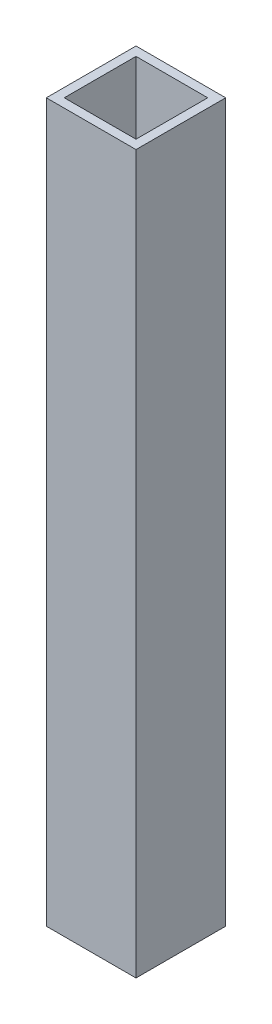
ISO-10303-21;
HEADER;
FILE_DESCRIPTION(('STEP AP214'),'2;1');
FILE_NAME('part.step','',(''),(''),'','','');
FILE_SCHEMA(('AUTOMOTIVE_DESIGN { 1 0 10303 214 1 1 1 1 }'));
ENDSEC;
DATA;
#1=APPLICATION_CONTEXT('core data for automotive mechanical design processes');
#2=APPLICATION_PROTOCOL_DEFINITION('international standard','automotive_design',2000,#1);
#3=PRODUCT_CONTEXT('',#1,'mechanical');
#4=PRODUCT('Part','Part','',(#3));
#5=PRODUCT_RELATED_PRODUCT_CATEGORY('part','',(#4));
#6=PRODUCT_DEFINITION_FORMATION('','',#4);
#7=PRODUCT_DEFINITION_CONTEXT('part definition',#1,'design');
#8=PRODUCT_DEFINITION('design','',#6,#7);
#9=PRODUCT_DEFINITION_SHAPE('','',#8);
#10=(LENGTH_UNIT() NAMED_UNIT(*) SI_UNIT(.MILLI.,.METRE.));
#11=(NAMED_UNIT(*) PLANE_ANGLE_UNIT() SI_UNIT($,.RADIAN.));
#12=(NAMED_UNIT(*) SI_UNIT($,.STERADIAN.) SOLID_ANGLE_UNIT());
#13=UNCERTAINTY_MEASURE_WITH_UNIT(LENGTH_MEASURE(1.E-05),#10,'distance_accuracy_value','');
#14=(GEOMETRIC_REPRESENTATION_CONTEXT(3) GLOBAL_UNCERTAINTY_ASSIGNED_CONTEXT((#13)) GLOBAL_UNIT_ASSIGNED_CONTEXT((#10,
#11,#12)) REPRESENTATION_CONTEXT('',''));
#15=CARTESIAN_POINT('',(0.,0.,0.));
#16=DIRECTION('',(0.,0.,1.));
#17=DIRECTION('',(1.,0.,0.));
#18=AXIS2_PLACEMENT_3D('',#15,#16,#17);
#19=CARTESIAN_POINT('',(15.,0.,-5.));
#20=DIRECTION('',(0.,0.,-1.));
#21=DIRECTION('',(-1.,0.,0.));
#22=AXIS2_PLACEMENT_3D('',#19,#20,#21);
#23=PLANE('',#22);
#24=DIRECTION('',(1.,0.,0.));
#25=VECTOR('',#24,1.);
#26=CARTESIAN_POINT('',(15.,-80.,-5.));
#27=LINE('',#26,#25);
#28=CARTESIAN_POINT('',(15.,-80.,-5.));
#29=VERTEX_POINT('',#28);
#30=CARTESIAN_POINT('',(25.,-80.,-5.));
#31=VERTEX_POINT('',#30);
#32=EDGE_CURVE('E131',#29,#31,#27,.T.);
#33=ORIENTED_EDGE('',*,*,#32,.F.);
#34=DIRECTION('',(0.,-1.,0.));
#35=VECTOR('',#34,1.);
#36=CARTESIAN_POINT('',(15.,0.,-5.));
#37=LINE('',#36,#35);
#38=CARTESIAN_POINT('',(15.,0.,-5.));
#39=VERTEX_POINT('',#38);
#40=EDGE_CURVE('E11',#39,#29,#37,.T.);
#41=ORIENTED_EDGE('',*,*,#40,.F.);
#42=DIRECTION('',(1.,0.,0.));
#43=VECTOR('',#42,1.);
#44=CARTESIAN_POINT('',(15.,0.,-5.));
#45=LINE('',#44,#43);
#46=CARTESIAN_POINT('',(25.,0.,-5.));
#47=VERTEX_POINT('',#46);
#48=EDGE_CURVE('E135',#39,#47,#45,.T.);
#49=ORIENTED_EDGE('',*,*,#48,.T.);
#50=DIRECTION('',(0.,-1.,0.));
#51=VECTOR('',#50,1.);
#52=CARTESIAN_POINT('',(25.,0.,-5.));
#53=LINE('',#52,#51);
#54=EDGE_CURVE('E36',#47,#31,#53,.T.);
#55=ORIENTED_EDGE('',*,*,#54,.T.);
#56=EDGE_LOOP('',(#33,#41,#49,#55));
#57=FACE_BOUND('',#56,.T.);
#58=ADVANCED_FACE('F33',(#57),#23,.T.);
#59=CARTESIAN_POINT('',(15.,0.,5.));
#60=DIRECTION('',(-1.,0.,0.));
#61=DIRECTION('',(0.,0.,1.));
#62=AXIS2_PLACEMENT_3D('',#59,#60,#61);
#63=PLANE('',#62);
#64=DIRECTION('',(0.,0.,-1.));
#65=VECTOR('',#64,1.);
#66=CARTESIAN_POINT('',(15.,-80.,5.));
#67=LINE('',#66,#65);
#68=CARTESIAN_POINT('',(15.,-80.,5.));
#69=VERTEX_POINT('',#68);
#70=EDGE_CURVE('E139',#69,#29,#67,.T.);
#71=ORIENTED_EDGE('',*,*,#70,.F.);
#72=DIRECTION('',(0.,-1.,0.));
#73=VECTOR('',#72,1.);
#74=CARTESIAN_POINT('',(15.,0.,5.));
#75=LINE('',#74,#73);
#76=CARTESIAN_POINT('',(15.,0.,5.));
#77=VERTEX_POINT('',#76);
#78=EDGE_CURVE('E41',#77,#69,#75,.T.);
#79=ORIENTED_EDGE('',*,*,#78,.F.);
#80=DIRECTION('',(0.,0.,-1.));
#81=VECTOR('',#80,1.);
#82=CARTESIAN_POINT('',(15.,0.,5.));
#83=LINE('',#82,#81);
#84=EDGE_CURVE('E145',#77,#39,#83,.T.);
#85=ORIENTED_EDGE('',*,*,#84,.T.);
#86=ORIENTED_EDGE('',*,*,#40,.T.);
#87=EDGE_LOOP('',(#71,#79,#85,#86));
#88=FACE_BOUND('',#87,.T.);
#89=ADVANCED_FACE('F171',(#88),#63,.T.);
#90=CARTESIAN_POINT('',(25.,0.,5.));
#91=DIRECTION('',(0.,0.,1.));
#92=DIRECTION('',(1.,0.,0.));
#93=AXIS2_PLACEMENT_3D('',#90,#91,#92);
#94=PLANE('',#93);
#95=DIRECTION('',(-1.,0.,0.));
#96=VECTOR('',#95,1.);
#97=CARTESIAN_POINT('',(25.,-80.,5.));
#98=LINE('',#97,#96);
#99=CARTESIAN_POINT('',(25.,-80.,5.));
#100=VERTEX_POINT('',#99);
#101=EDGE_CURVE('E153',#100,#69,#98,.T.);
#102=ORIENTED_EDGE('',*,*,#101,.F.);
#103=DIRECTION('',(0.,-1.,0.));
#104=VECTOR('',#103,1.);
#105=CARTESIAN_POINT('',(25.,0.,5.));
#106=LINE('',#105,#104);
#107=CARTESIAN_POINT('',(25.,0.,5.));
#108=VERTEX_POINT('',#107);
#109=EDGE_CURVE('E158',#108,#100,#106,.T.);
#110=ORIENTED_EDGE('',*,*,#109,.F.);
#111=DIRECTION('',(-1.,0.,0.));
#112=VECTOR('',#111,1.);
#113=CARTESIAN_POINT('',(25.,0.,5.));
#114=LINE('',#113,#112);
#115=EDGE_CURVE('E142',#108,#77,#114,.T.);
#116=ORIENTED_EDGE('',*,*,#115,.T.);
#117=ORIENTED_EDGE('',*,*,#78,.T.);
#118=EDGE_LOOP('',(#102,#110,#116,#117));
#119=FACE_BOUND('',#118,.T.);
#120=ADVANCED_FACE('F175',(#119),#94,.T.);
#121=CARTESIAN_POINT('',(25.,0.,-5.));
#122=DIRECTION('',(1.,0.,0.));
#123=DIRECTION('',(0.,0.,-1.));
#124=AXIS2_PLACEMENT_3D('',#121,#122,#123);
#125=PLANE('',#124);
#126=DIRECTION('',(0.,0.,1.));
#127=VECTOR('',#126,1.);
#128=CARTESIAN_POINT('',(25.,-80.,-5.));
#129=LINE('',#128,#127);
#130=EDGE_CURVE('E150',#31,#100,#129,.T.);
#131=ORIENTED_EDGE('',*,*,#130,.F.);
#132=ORIENTED_EDGE('',*,*,#54,.F.);
#133=DIRECTION('',(0.,0.,1.));
#134=VECTOR('',#133,1.);
#135=CARTESIAN_POINT('',(25.,0.,-5.));
#136=LINE('',#135,#134);
#137=EDGE_CURVE('E138',#47,#108,#136,.T.);
#138=ORIENTED_EDGE('',*,*,#137,.T.);
#139=ORIENTED_EDGE('',*,*,#109,.T.);
#140=EDGE_LOOP('',(#131,#132,#138,#139));
#141=FACE_BOUND('',#140,.T.);
#142=ADVANCED_FACE('F166',(#141),#125,.T.);
#143=CARTESIAN_POINT('',(0.,0.,0.));
#144=DIRECTION('',(0.,-1.,0.));
#145=DIRECTION('',(0.,0.,-1.));
#146=AXIS2_PLACEMENT_3D('',#143,#144,#145);
#147=PLANE('',#146);
#148=DIRECTION('',(0.,0.,1.));
#149=VECTOR('',#148,1.);
#150=CARTESIAN_POINT('',(24.,0.,4.));
#151=LINE('',#150,#149);
#152=CARTESIAN_POINT('',(24.,0.,-4.));
#153=VERTEX_POINT('',#152);
#154=CARTESIAN_POINT('',(24.,0.,4.));
#155=VERTEX_POINT('',#154);
#156=EDGE_CURVE('E106',#153,#155,#151,.T.);
#157=ORIENTED_EDGE('',*,*,#156,.T.);
#158=DIRECTION('',(-1.,0.,0.));
#159=VECTOR('',#158,1.);
#160=CARTESIAN_POINT('',(16.,0.,4.));
#161=LINE('',#160,#159);
#162=CARTESIAN_POINT('',(16.,0.,4.));
#163=VERTEX_POINT('',#162);
#164=EDGE_CURVE('E100',#155,#163,#161,.T.);
#165=ORIENTED_EDGE('',*,*,#164,.T.);
#166=DIRECTION('',(0.,0.,-1.));
#167=VECTOR('',#166,1.);
#168=CARTESIAN_POINT('',(16.,0.,-4.));
#169=LINE('',#168,#167);
#170=CARTESIAN_POINT('',(16.,0.,-4.));
#171=VERTEX_POINT('',#170);
#172=EDGE_CURVE('E109',#163,#171,#169,.T.);
#173=ORIENTED_EDGE('',*,*,#172,.T.);
#174=DIRECTION('',(1.,0.,0.));
#175=VECTOR('',#174,1.);
#176=CARTESIAN_POINT('',(24.,0.,-4.));
#177=LINE('',#176,#175);
#178=EDGE_CURVE('E49',#171,#153,#177,.T.);
#179=ORIENTED_EDGE('',*,*,#178,.T.);
#180=EDGE_LOOP('',(#157,#165,#173,#179));
#181=FACE_BOUND('',#180,.T.);
#182=ORIENTED_EDGE('',*,*,#48,.F.);
#183=ORIENTED_EDGE('',*,*,#84,.F.);
#184=ORIENTED_EDGE('',*,*,#115,.F.);
#185=ORIENTED_EDGE('',*,*,#137,.F.);
#186=EDGE_LOOP('',(#182,#183,#184,#185));
#187=FACE_BOUND('',#186,.T.);
#188=ADVANCED_FACE('F113',(#181,#187),#147,.F.);
#189=CARTESIAN_POINT('',(0.,-80.,0.));
#190=DIRECTION('',(0.,-1.,0.));
#191=DIRECTION('',(0.,0.,-1.));
#192=AXIS2_PLACEMENT_3D('',#189,#190,#191);
#193=PLANE('',#192);
#194=DIRECTION('',(-1.,0.,0.));
#195=VECTOR('',#194,1.);
#196=CARTESIAN_POINT('',(16.,-80.,4.));
#197=LINE('',#196,#195);
#198=CARTESIAN_POINT('',(24.,-80.,4.));
#199=VERTEX_POINT('',#198);
#200=CARTESIAN_POINT('',(16.,-80.,4.));
#201=VERTEX_POINT('',#200);
#202=EDGE_CURVE('E57',#199,#201,#197,.T.);
#203=ORIENTED_EDGE('',*,*,#202,.F.);
#204=DIRECTION('',(0.,0.,1.));
#205=VECTOR('',#204,1.);
#206=CARTESIAN_POINT('',(24.,-80.,4.));
#207=LINE('',#206,#205);
#208=CARTESIAN_POINT('',(24.,-80.,-4.));
#209=VERTEX_POINT('',#208);
#210=EDGE_CURVE('E116',#209,#199,#207,.T.);
#211=ORIENTED_EDGE('',*,*,#210,.F.);
#212=DIRECTION('',(1.,0.,0.));
#213=VECTOR('',#212,1.);
#214=CARTESIAN_POINT('',(24.,-80.,-4.));
#215=LINE('',#214,#213);
#216=CARTESIAN_POINT('',(16.,-80.,-4.));
#217=VERTEX_POINT('',#216);
#218=EDGE_CURVE('E119',#217,#209,#215,.T.);
#219=ORIENTED_EDGE('',*,*,#218,.F.);
#220=DIRECTION('',(0.,0.,-1.));
#221=VECTOR('',#220,1.);
#222=CARTESIAN_POINT('',(16.,-80.,-4.));
#223=LINE('',#222,#221);
#224=EDGE_CURVE('E125',#201,#217,#223,.T.);
#225=ORIENTED_EDGE('',*,*,#224,.F.);
#226=EDGE_LOOP('',(#203,#211,#219,#225));
#227=FACE_BOUND('',#226,.T.);
#228=ORIENTED_EDGE('',*,*,#32,.T.);
#229=ORIENTED_EDGE('',*,*,#130,.T.);
#230=ORIENTED_EDGE('',*,*,#101,.T.);
#231=ORIENTED_EDGE('',*,*,#70,.T.);
#232=EDGE_LOOP('',(#228,#229,#230,#231));
#233=FACE_BOUND('',#232,.T.);
#234=ADVANCED_FACE('F168',(#227,#233),#193,.T.);
#235=CARTESIAN_POINT('',(16.,0.,4.));
#236=DIRECTION('',(0.,0.,1.));
#237=DIRECTION('',(1.,0.,0.));
#238=AXIS2_PLACEMENT_3D('',#235,#236,#237);
#239=PLANE('',#238);
#240=ORIENTED_EDGE('',*,*,#202,.T.);
#241=DIRECTION('',(0.,-1.,0.));
#242=VECTOR('',#241,1.);
#243=CARTESIAN_POINT('',(16.,0.,4.));
#244=LINE('',#243,#242);
#245=EDGE_CURVE('E96',#163,#201,#244,.T.);
#246=ORIENTED_EDGE('',*,*,#245,.F.);
#247=ORIENTED_EDGE('',*,*,#164,.F.);
#248=DIRECTION('',(0.,-1.,0.));
#249=VECTOR('',#248,1.);
#250=CARTESIAN_POINT('',(24.,0.,4.));
#251=LINE('',#250,#249);
#252=EDGE_CURVE('E129',#155,#199,#251,.T.);
#253=ORIENTED_EDGE('',*,*,#252,.T.);
#254=EDGE_LOOP('',(#240,#246,#247,#253));
#255=FACE_BOUND('',#254,.T.);
#256=ADVANCED_FACE('F98',(#255),#239,.F.);
#257=CARTESIAN_POINT('',(24.,0.,4.));
#258=DIRECTION('',(1.,0.,0.));
#259=DIRECTION('',(0.,0.,-1.));
#260=AXIS2_PLACEMENT_3D('',#257,#258,#259);
#261=PLANE('',#260);
#262=ORIENTED_EDGE('',*,*,#210,.T.);
#263=ORIENTED_EDGE('',*,*,#252,.F.);
#264=ORIENTED_EDGE('',*,*,#156,.F.);
#265=DIRECTION('',(0.,-1.,0.));
#266=VECTOR('',#265,1.);
#267=CARTESIAN_POINT('',(24.,0.,-4.));
#268=LINE('',#267,#266);
#269=EDGE_CURVE('E132',#153,#209,#268,.T.);
#270=ORIENTED_EDGE('',*,*,#269,.T.);
#271=EDGE_LOOP('',(#262,#263,#264,#270));
#272=FACE_BOUND('',#271,.T.);
#273=ADVANCED_FACE('F226',(#272),#261,.F.);
#274=CARTESIAN_POINT('',(24.,0.,-4.));
#275=DIRECTION('',(0.,0.,-1.));
#276=DIRECTION('',(-1.,0.,0.));
#277=AXIS2_PLACEMENT_3D('',#274,#275,#276);
#278=PLANE('',#277);
#279=ORIENTED_EDGE('',*,*,#218,.T.);
#280=ORIENTED_EDGE('',*,*,#269,.F.);
#281=ORIENTED_EDGE('',*,*,#178,.F.);
#282=DIRECTION('',(0.,-1.,0.));
#283=VECTOR('',#282,1.);
#284=CARTESIAN_POINT('',(16.,0.,-4.));
#285=LINE('',#284,#283);
#286=EDGE_CURVE('E105',#171,#217,#285,.T.);
#287=ORIENTED_EDGE('',*,*,#286,.T.);
#288=EDGE_LOOP('',(#279,#280,#281,#287));
#289=FACE_BOUND('',#288,.T.);
#290=ADVANCED_FACE('F235',(#289),#278,.F.);
#291=CARTESIAN_POINT('',(16.,0.,-4.));
#292=DIRECTION('',(-1.,0.,0.));
#293=DIRECTION('',(0.,0.,1.));
#294=AXIS2_PLACEMENT_3D('',#291,#292,#293);
#295=PLANE('',#294);
#296=ORIENTED_EDGE('',*,*,#224,.T.);
#297=ORIENTED_EDGE('',*,*,#286,.F.);
#298=ORIENTED_EDGE('',*,*,#172,.F.);
#299=ORIENTED_EDGE('',*,*,#245,.T.);
#300=EDGE_LOOP('',(#296,#297,#298,#299));
#301=FACE_BOUND('',#300,.T.);
#302=ADVANCED_FACE('F110',(#301),#295,.F.);
#303=CLOSED_SHELL('',(#58,#89,#120,#142,#188,#234,#256,#273,#290,#302));
#304=MANIFOLD_SOLID_BREP('B2',#303);
#305=ADVANCED_BREP_SHAPE_REPRESENTATION('',(#18,#304),#14);
#306=SHAPE_DEFINITION_REPRESENTATION(#9,#305);
ENDSEC;
END-ISO-10303-21;
